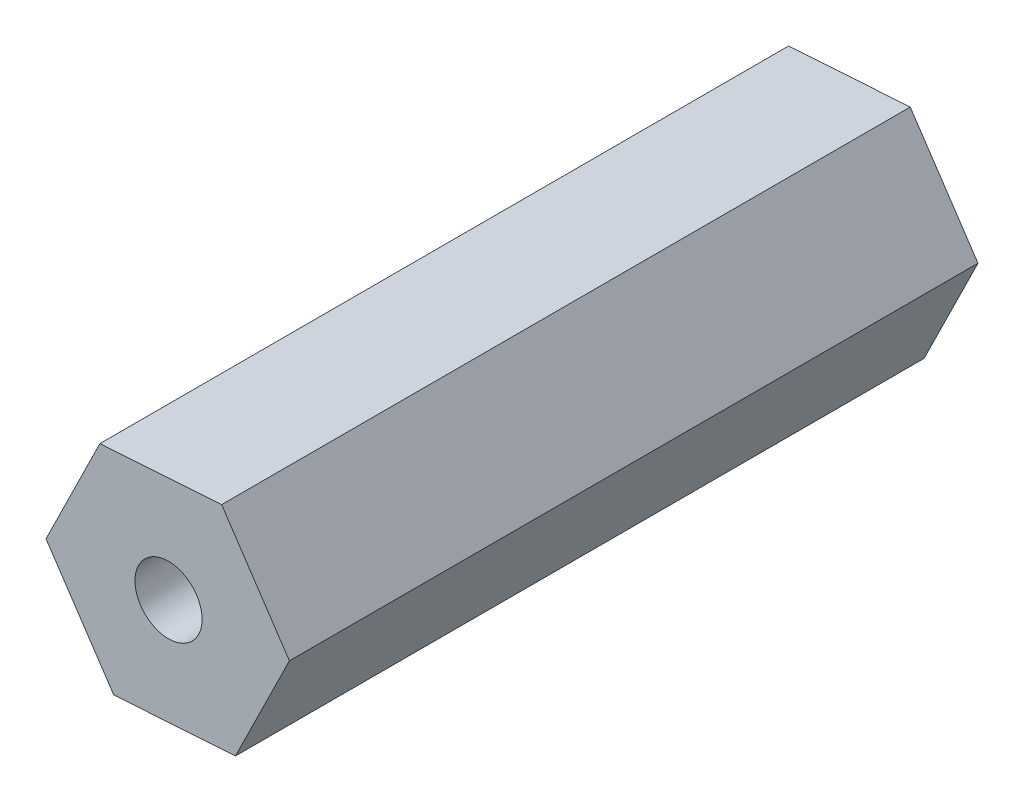
ISO-10303-21;
HEADER;
FILE_DESCRIPTION(('STEP AP214'),'2;1');
FILE_NAME('part.step','',(''),(''),'','','');
FILE_SCHEMA(('AUTOMOTIVE_DESIGN { 1 0 10303 214 1 1 1 1 }'));
ENDSEC;
DATA;
#1=APPLICATION_CONTEXT('core data for automotive mechanical design processes');
#2=APPLICATION_PROTOCOL_DEFINITION('international standard','automotive_design',2000,#1);
#3=PRODUCT_CONTEXT('',#1,'mechanical');
#4=PRODUCT('Part','Part','',(#3));
#5=PRODUCT_RELATED_PRODUCT_CATEGORY('part','',(#4));
#6=PRODUCT_DEFINITION_FORMATION('','',#4);
#7=PRODUCT_DEFINITION_CONTEXT('part definition',#1,'design');
#8=PRODUCT_DEFINITION('design','',#6,#7);
#9=PRODUCT_DEFINITION_SHAPE('','',#8);
#10=(LENGTH_UNIT() NAMED_UNIT(*) SI_UNIT(.MILLI.,.METRE.));
#11=(NAMED_UNIT(*) PLANE_ANGLE_UNIT() SI_UNIT($,.RADIAN.));
#12=(NAMED_UNIT(*) SI_UNIT($,.STERADIAN.) SOLID_ANGLE_UNIT());
#13=UNCERTAINTY_MEASURE_WITH_UNIT(LENGTH_MEASURE(1.E-05),#10,'distance_accuracy_value','');
#14=(GEOMETRIC_REPRESENTATION_CONTEXT(3) GLOBAL_UNCERTAINTY_ASSIGNED_CONTEXT((#13)) GLOBAL_UNIT_ASSIGNED_CONTEXT((#10,
#11,#12)) REPRESENTATION_CONTEXT('',''));
#15=CARTESIAN_POINT('',(0.,0.,0.));
#16=DIRECTION('',(0.,0.,1.));
#17=DIRECTION('',(1.,0.,0.));
#18=AXIS2_PLACEMENT_3D('',#15,#16,#17);
#19=CARTESIAN_POINT('',(7.31660213341362,0.480277580843075,41.402));
#20=DIRECTION('',(-0.831415008995449,-0.555651943951515,0.));
#21=DIRECTION('',(0.555651943951515,-0.831415008995449,0.));
#22=AXIS2_PLACEMENT_3D('',#19,#20,#21);
#23=PLANE('',#22);
#24=DIRECTION('',(-0.555651943951515,0.831415008995449,0.));
#25=VECTOR('',#24,1.);
#26=CARTESIAN_POINT('',(7.31660213341362,0.480277580843075,0.));
#27=LINE('',#26,#25);
#28=CARTESIAN_POINT('',(7.31660213341362,0.480277580843075,0.));
#29=VERTEX_POINT('',#28);
#30=CARTESIAN_POINT('',(3.24236848082857,6.57650210734116,0.));
#31=VERTEX_POINT('',#30);
#32=EDGE_CURVE('E117',#29,#31,#27,.T.);
#33=ORIENTED_EDGE('',*,*,#32,.T.);
#34=DIRECTION('',(0.,0.,-1.));
#35=VECTOR('',#34,1.);
#36=CARTESIAN_POINT('',(3.24236848082857,6.57650210734116,41.402));
#37=LINE('',#36,#35);
#38=CARTESIAN_POINT('',(3.24236848082857,6.57650210734116,41.402));
#39=VERTEX_POINT('',#38);
#40=EDGE_CURVE('E11',#39,#31,#37,.T.);
#41=ORIENTED_EDGE('',*,*,#40,.F.);
#42=DIRECTION('',(-0.555651943951515,0.831415008995449,0.));
#43=VECTOR('',#42,1.);
#44=CARTESIAN_POINT('',(7.31660213341362,0.480277580843075,41.402));
#45=LINE('',#44,#43);
#46=CARTESIAN_POINT('',(7.31660213341362,0.480277580843075,41.402));
#47=VERTEX_POINT('',#46);
#48=EDGE_CURVE('E128',#47,#39,#45,.T.);
#49=ORIENTED_EDGE('',*,*,#48,.F.);
#50=DIRECTION('',(0.,0.,-1.));
#51=VECTOR('',#50,1.);
#52=CARTESIAN_POINT('',(7.31660213341362,0.480277580843075,41.402));
#53=LINE('',#52,#51);
#54=EDGE_CURVE('E113',#47,#29,#53,.T.);
#55=ORIENTED_EDGE('',*,*,#54,.T.);
#56=EDGE_LOOP('',(#33,#41,#49,#55));
#57=FACE_BOUND('',#56,.T.);
#58=ADVANCED_FACE('F33',(#57),#23,.F.);
#59=CARTESIAN_POINT('',(3.24236848082857,6.57650210734116,41.402));
#60=DIRECTION('',(0.0655011946264941,-0.997852490853484,0.));
#61=DIRECTION('',(0.997852490853484,0.0655011946264941,0.));
#62=AXIS2_PLACEMENT_3D('',#59,#60,#61);
#63=PLANE('',#62);
#64=DIRECTION('',(-0.997852490853484,-0.0655011946264941,0.));
#65=VECTOR('',#64,1.);
#66=CARTESIAN_POINT('',(3.24236848082857,6.57650210734116,0.));
#67=LINE('',#66,#65);
#68=CARTESIAN_POINT('',(-4.07423365258505,6.09622452649808,0.));
#69=VERTEX_POINT('',#68);
#70=EDGE_CURVE('E120',#31,#69,#67,.T.);
#71=ORIENTED_EDGE('',*,*,#70,.T.);
#72=DIRECTION('',(0.,0.,-1.));
#73=VECTOR('',#72,1.);
#74=CARTESIAN_POINT('',(-4.07423365258505,6.09622452649808,41.402));
#75=LINE('',#74,#73);
#76=CARTESIAN_POINT('',(-4.07423365258505,6.09622452649808,41.402));
#77=VERTEX_POINT('',#76);
#78=EDGE_CURVE('E41',#77,#69,#75,.T.);
#79=ORIENTED_EDGE('',*,*,#78,.F.);
#80=DIRECTION('',(-0.997852490853484,-0.0655011946264941,0.));
#81=VECTOR('',#80,1.);
#82=CARTESIAN_POINT('',(3.24236848082857,6.57650210734116,41.402));
#83=LINE('',#82,#81);
#84=EDGE_CURVE('E86',#39,#77,#83,.T.);
#85=ORIENTED_EDGE('',*,*,#84,.F.);
#86=ORIENTED_EDGE('',*,*,#40,.T.);
#87=EDGE_LOOP('',(#71,#79,#85,#86));
#88=FACE_BOUND('',#87,.T.);
#89=ADVANCED_FACE('F153',(#88),#63,.F.);
#90=CARTESIAN_POINT('',(-4.07423365258505,6.09622452649808,41.402));
#91=DIRECTION('',(0.896916203621943,-0.442200546901969,0.));
#92=DIRECTION('',(0.442200546901969,0.896916203621943,0.));
#93=AXIS2_PLACEMENT_3D('',#90,#91,#92);
#94=PLANE('',#93);
#95=DIRECTION('',(-0.442200546901969,-0.896916203621943,0.));
#96=VECTOR('',#95,1.);
#97=CARTESIAN_POINT('',(-4.07423365258505,6.09622452649808,0.));
#98=LINE('',#97,#96);
#99=CARTESIAN_POINT('',(-7.31660213341362,-0.480277580843077,0.));
#100=VERTEX_POINT('',#99);
#101=EDGE_CURVE('E123',#69,#100,#98,.T.);
#102=ORIENTED_EDGE('',*,*,#101,.T.);
#103=DIRECTION('',(0.,0.,-1.));
#104=VECTOR('',#103,1.);
#105=CARTESIAN_POINT('',(-7.31660213341362,-0.480277580843077,41.402));
#106=LINE('',#105,#104);
#107=CARTESIAN_POINT('',(-7.31660213341362,-0.480277580843077,41.402));
#108=VERTEX_POINT('',#107);
#109=EDGE_CURVE('E108',#108,#100,#106,.T.);
#110=ORIENTED_EDGE('',*,*,#109,.F.);
#111=DIRECTION('',(-0.442200546901969,-0.896916203621943,0.));
#112=VECTOR('',#111,1.);
#113=CARTESIAN_POINT('',(-4.07423365258505,6.09622452649808,41.402));
#114=LINE('',#113,#112);
#115=EDGE_CURVE('E99',#77,#108,#114,.T.);
#116=ORIENTED_EDGE('',*,*,#115,.F.);
#117=ORIENTED_EDGE('',*,*,#78,.T.);
#118=EDGE_LOOP('',(#102,#110,#116,#117));
#119=FACE_BOUND('',#118,.T.);
#120=ADVANCED_FACE('F134',(#119),#94,.F.);
#121=CARTESIAN_POINT('',(-7.31660213341362,-0.480277580843077,41.402));
#122=DIRECTION('',(0.831415008995449,0.555651943951515,0.));
#123=DIRECTION('',(-0.555651943951515,0.831415008995449,0.));
#124=AXIS2_PLACEMENT_3D('',#121,#122,#123);
#125=PLANE('',#124);
#126=DIRECTION('',(0.555651943951515,-0.831415008995449,0.));
#127=VECTOR('',#126,1.);
#128=CARTESIAN_POINT('',(-7.31660213341362,-0.480277580843077,0.));
#129=LINE('',#128,#127);
#130=CARTESIAN_POINT('',(-3.24236848082857,-6.57650210734116,0.));
#131=VERTEX_POINT('',#130);
#132=EDGE_CURVE('E107',#100,#131,#129,.T.);
#133=ORIENTED_EDGE('',*,*,#132,.T.);
#134=DIRECTION('',(0.,0.,-1.));
#135=VECTOR('',#134,1.);
#136=CARTESIAN_POINT('',(-3.24236848082857,-6.57650210734116,41.402));
#137=LINE('',#136,#135);
#138=CARTESIAN_POINT('',(-3.24236848082857,-6.57650210734116,41.402));
#139=VERTEX_POINT('',#138);
#140=EDGE_CURVE('E104',#139,#131,#137,.T.);
#141=ORIENTED_EDGE('',*,*,#140,.F.);
#142=DIRECTION('',(0.555651943951515,-0.831415008995449,0.));
#143=VECTOR('',#142,1.);
#144=CARTESIAN_POINT('',(-7.31660213341362,-0.480277580843077,41.402));
#145=LINE('',#144,#143);
#146=EDGE_CURVE('E93',#108,#139,#145,.T.);
#147=ORIENTED_EDGE('',*,*,#146,.F.);
#148=ORIENTED_EDGE('',*,*,#109,.T.);
#149=EDGE_LOOP('',(#133,#141,#147,#148));
#150=FACE_BOUND('',#149,.T.);
#151=ADVANCED_FACE('F105',(#150),#125,.F.);
#152=CARTESIAN_POINT('',(-3.24236848082857,-6.57650210734116,41.402));
#153=DIRECTION('',(-0.0655011946264938,0.997852490853484,0.));
#154=DIRECTION('',(-0.997852490853484,-0.0655011946264938,0.));
#155=AXIS2_PLACEMENT_3D('',#152,#153,#154);
#156=PLANE('',#155);
#157=DIRECTION('',(0.997852490853484,0.0655011946264938,0.));
#158=VECTOR('',#157,1.);
#159=CARTESIAN_POINT('',(-3.24236848082857,-6.57650210734116,0.));
#160=LINE('',#159,#158);
#161=CARTESIAN_POINT('',(4.07423365258504,-6.09622452649809,0.));
#162=VERTEX_POINT('',#161);
#163=EDGE_CURVE('E72',#131,#162,#160,.T.);
#164=ORIENTED_EDGE('',*,*,#163,.T.);
#165=DIRECTION('',(0.,0.,-1.));
#166=VECTOR('',#165,1.);
#167=CARTESIAN_POINT('',(4.07423365258504,-6.09622452649809,41.402));
#168=LINE('',#167,#166);
#169=CARTESIAN_POINT('',(4.07423365258504,-6.09622452649809,41.402));
#170=VERTEX_POINT('',#169);
#171=EDGE_CURVE('E109',#170,#162,#168,.T.);
#172=ORIENTED_EDGE('',*,*,#171,.F.);
#173=DIRECTION('',(0.997852490853484,0.0655011946264938,0.));
#174=VECTOR('',#173,1.);
#175=CARTESIAN_POINT('',(-3.24236848082857,-6.57650210734116,41.402));
#176=LINE('',#175,#174);
#177=EDGE_CURVE('E97',#139,#170,#176,.T.);
#178=ORIENTED_EDGE('',*,*,#177,.F.);
#179=ORIENTED_EDGE('',*,*,#140,.T.);
#180=EDGE_LOOP('',(#164,#172,#178,#179));
#181=FACE_BOUND('',#180,.T.);
#182=ADVANCED_FACE('F111',(#181),#156,.F.);
#183=CARTESIAN_POINT('',(4.07423365258504,-6.09622452649809,41.402));
#184=DIRECTION('',(-0.896916203621943,0.44220054690197,0.));
#185=DIRECTION('',(-0.44220054690197,-0.896916203621943,0.));
#186=AXIS2_PLACEMENT_3D('',#183,#184,#185);
#187=PLANE('',#186);
#188=DIRECTION('',(0.44220054690197,0.896916203621943,0.));
#189=VECTOR('',#188,1.);
#190=CARTESIAN_POINT('',(4.07423365258504,-6.09622452649809,0.));
#191=LINE('',#190,#189);
#192=EDGE_CURVE('E78',#162,#29,#191,.T.);
#193=ORIENTED_EDGE('',*,*,#192,.T.);
#194=ORIENTED_EDGE('',*,*,#54,.F.);
#195=DIRECTION('',(0.44220054690197,0.896916203621943,0.));
#196=VECTOR('',#195,1.);
#197=CARTESIAN_POINT('',(4.07423365258504,-6.09622452649809,41.402));
#198=LINE('',#197,#196);
#199=EDGE_CURVE('E49',#170,#47,#198,.T.);
#200=ORIENTED_EDGE('',*,*,#199,.F.);
#201=ORIENTED_EDGE('',*,*,#171,.T.);
#202=EDGE_LOOP('',(#193,#194,#200,#201));
#203=FACE_BOUND('',#202,.T.);
#204=ADVANCED_FACE('F141',(#203),#187,.F.);
#205=CARTESIAN_POINT('',(0.,0.,41.402));
#206=DIRECTION('',(0.,0.,1.));
#207=DIRECTION('',(1.,0.,0.));
#208=AXIS2_PLACEMENT_3D('',#205,#206,#207);
#209=PLANE('',#208);
#210=CARTESIAN_POINT('',(0.049397866586376,0.0136366830803779,41.402));
#211=DIRECTION('',(0.,0.,1.));
#212=DIRECTION('',(1.,0.,0.));
#213=AXIS2_PLACEMENT_3D('',#210,#211,#212);
#214=CIRCLE('',#213,2.0193);
#215=CARTESIAN_POINT('',(2.06869786658638,0.0136366830803779,41.402));
#216=VERTEX_POINT('',#215);
#217=EDGE_CURVE('E236',#216,#216,#214,.T.);
#218=ORIENTED_EDGE('',*,*,#217,.F.);
#219=EDGE_LOOP('',(#218));
#220=FACE_BOUND('',#219,.T.);
#221=ORIENTED_EDGE('',*,*,#48,.T.);
#222=ORIENTED_EDGE('',*,*,#84,.T.);
#223=ORIENTED_EDGE('',*,*,#115,.T.);
#224=ORIENTED_EDGE('',*,*,#146,.T.);
#225=ORIENTED_EDGE('',*,*,#177,.T.);
#226=ORIENTED_EDGE('',*,*,#199,.T.);
#227=EDGE_LOOP('',(#221,#222,#223,#224,#225,#226));
#228=FACE_BOUND('',#227,.T.);
#229=ADVANCED_FACE('F95',(#220,#228),#209,.T.);
#230=CARTESIAN_POINT('',(0.,0.,0.));
#231=DIRECTION('',(0.,0.,1.));
#232=DIRECTION('',(1.,0.,0.));
#233=AXIS2_PLACEMENT_3D('',#230,#231,#232);
#234=PLANE('',#233);
#235=CARTESIAN_POINT('',(-0.0493978665863752,-0.0032425827495193,0.));
#236=DIRECTION('',(0.,0.,-1.));
#237=DIRECTION('',(-1.,0.,0.));
#238=AXIS2_PLACEMENT_3D('',#235,#236,#237);
#239=CIRCLE('',#238,1.84283509410426);
#240=CARTESIAN_POINT('',(-1.89223296069064,-0.0032425827495193,0.));
#241=VERTEX_POINT('',#240);
#242=EDGE_CURVE('E237',#241,#241,#239,.T.);
#243=ORIENTED_EDGE('',*,*,#242,.F.);
#244=EDGE_LOOP('',(#243));
#245=FACE_BOUND('',#244,.T.);
#246=ORIENTED_EDGE('',*,*,#32,.F.);
#247=ORIENTED_EDGE('',*,*,#192,.F.);
#248=ORIENTED_EDGE('',*,*,#163,.F.);
#249=ORIENTED_EDGE('',*,*,#132,.F.);
#250=ORIENTED_EDGE('',*,*,#101,.F.);
#251=ORIENTED_EDGE('',*,*,#70,.F.);
#252=EDGE_LOOP('',(#246,#247,#248,#249,#250,#251));
#253=FACE_BOUND('',#252,.T.);
#254=ADVANCED_FACE('F137',(#245,#253),#234,.F.);
#255=CARTESIAN_POINT('',(0.049397866586376,0.0136366830803779,28.702));
#256=DIRECTION('',(0.,0.,1.));
#257=DIRECTION('',(1.,0.,0.));
#258=AXIS2_PLACEMENT_3D('',#255,#256,#257);
#259=CYLINDRICAL_SURFACE('',#258,2.0193);
#260=CARTESIAN_POINT('',(0.049397866586376,0.0136366830803779,28.702));
#261=DIRECTION('',(0.,0.,1.));
#262=DIRECTION('',(1.,0.,0.));
#263=AXIS2_PLACEMENT_3D('',#260,#261,#262);
#264=CIRCLE('',#263,2.0193);
#265=CARTESIAN_POINT('',(2.06869786658638,0.0136366830803779,28.702));
#266=VERTEX_POINT('',#265);
#267=EDGE_CURVE('E121',#266,#266,#264,.T.);
#268=ORIENTED_EDGE('',*,*,#267,.F.);
#269=EDGE_LOOP('',(#268));
#270=FACE_BOUND('',#269,.T.);
#271=ORIENTED_EDGE('',*,*,#217,.T.);
#272=EDGE_LOOP('',(#271));
#273=FACE_BOUND('',#272,.T.);
#274=ADVANCED_FACE('F188',(#270,#273),#259,.F.);
#275=CARTESIAN_POINT('',(0.049397866586376,0.0136366830803779,28.702));
#276=DIRECTION('',(0.,0.,1.));
#277=DIRECTION('',(1.,0.,0.));
#278=AXIS2_PLACEMENT_3D('',#275,#276,#277);
#279=PLANE('',#278);
#280=ORIENTED_EDGE('',*,*,#267,.T.);
#281=EDGE_LOOP('',(#280));
#282=FACE_BOUND('',#281,.T.);
#283=ADVANCED_FACE('F193',(#282),#279,.T.);
#284=CARTESIAN_POINT('',(-0.0493978665863752,-0.0032425827495193,12.7));
#285=DIRECTION('',(0.,0.,-1.));
#286=DIRECTION('',(-1.,0.,0.));
#287=AXIS2_PLACEMENT_3D('',#284,#285,#286);
#288=CYLINDRICAL_SURFACE('',#287,1.84283509410426);
#289=CARTESIAN_POINT('',(-0.0493978665863752,-0.0032425827495193,12.7));
#290=DIRECTION('',(0.,0.,-1.));
#291=DIRECTION('',(-1.,0.,0.));
#292=AXIS2_PLACEMENT_3D('',#289,#290,#291);
#293=CIRCLE('',#292,1.84283509410426);
#294=CARTESIAN_POINT('',(-1.89223296069064,-0.0032425827495193,12.7));
#295=VERTEX_POINT('',#294);
#296=EDGE_CURVE('E235',#295,#295,#293,.T.);
#297=ORIENTED_EDGE('',*,*,#296,.F.);
#298=EDGE_LOOP('',(#297));
#299=FACE_BOUND('',#298,.T.);
#300=ORIENTED_EDGE('',*,*,#242,.T.);
#301=EDGE_LOOP('',(#300));
#302=FACE_BOUND('',#301,.T.);
#303=ADVANCED_FACE('F203',(#299,#302),#288,.F.);
#304=CARTESIAN_POINT('',(-0.0493978665863752,-0.0032425827495193,12.7));
#305=DIRECTION('',(0.,0.,-1.));
#306=DIRECTION('',(-1.,0.,0.));
#307=AXIS2_PLACEMENT_3D('',#304,#305,#306);
#308=PLANE('',#307);
#309=ORIENTED_EDGE('',*,*,#296,.T.);
#310=EDGE_LOOP('',(#309));
#311=FACE_BOUND('',#310,.T.);
#312=ADVANCED_FACE('F219',(#311),#308,.T.);
#313=CLOSED_SHELL('',(#58,#89,#120,#151,#182,#204,#229,#254,#274,#283,#303,#312));
#314=MANIFOLD_SOLID_BREP('B2',#313);
#315=ADVANCED_BREP_SHAPE_REPRESENTATION('',(#18,#314),#14);
#316=SHAPE_DEFINITION_REPRESENTATION(#9,#315);
ENDSEC;
END-ISO-10303-21;
